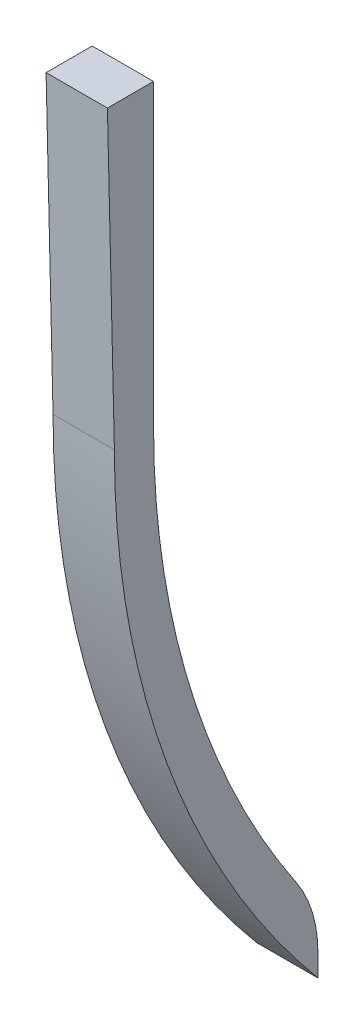
ISO-10303-21;
HEADER;
FILE_DESCRIPTION(('STEP AP214'),'2;1');
FILE_NAME('part.step','',(''),(''),'','','');
FILE_SCHEMA(('AUTOMOTIVE_DESIGN { 1 0 10303 214 1 1 1 1 }'));
ENDSEC;
DATA;
#1=APPLICATION_CONTEXT('core data for automotive mechanical design processes');
#2=APPLICATION_PROTOCOL_DEFINITION('international standard','automotive_design',2000,#1);
#3=PRODUCT_CONTEXT('',#1,'mechanical');
#4=PRODUCT('Part','Part','',(#3));
#5=PRODUCT_RELATED_PRODUCT_CATEGORY('part','',(#4));
#6=PRODUCT_DEFINITION_FORMATION('','',#4);
#7=PRODUCT_DEFINITION_CONTEXT('part definition',#1,'design');
#8=PRODUCT_DEFINITION('design','',#6,#7);
#9=PRODUCT_DEFINITION_SHAPE('','',#8);
#10=(LENGTH_UNIT() NAMED_UNIT(*) SI_UNIT(.MILLI.,.METRE.));
#11=(NAMED_UNIT(*) PLANE_ANGLE_UNIT() SI_UNIT($,.RADIAN.));
#12=(NAMED_UNIT(*) SI_UNIT($,.STERADIAN.) SOLID_ANGLE_UNIT());
#13=UNCERTAINTY_MEASURE_WITH_UNIT(LENGTH_MEASURE(1.E-05),#10,'distance_accuracy_value','');
#14=(GEOMETRIC_REPRESENTATION_CONTEXT(3) GLOBAL_UNCERTAINTY_ASSIGNED_CONTEXT((#13)) GLOBAL_UNIT_ASSIGNED_CONTEXT((#10,
#11,#12)) REPRESENTATION_CONTEXT('',''));
#15=CARTESIAN_POINT('',(0.,0.,0.));
#16=DIRECTION('',(0.,0.,1.));
#17=DIRECTION('',(1.,0.,0.));
#18=AXIS2_PLACEMENT_3D('',#15,#16,#17);
#19=CARTESIAN_POINT('',(2.3876,-146.926703399553,-5.84262807197812));
#20=DIRECTION('',(-1.,0.,0.));
#21=DIRECTION('',(0.,0.,1.));
#22=AXIS2_PLACEMENT_3D('',#19,#20,#21);
#23=CYLINDRICAL_SURFACE('',#22,10.);
#24=DIRECTION('',(-1.,0.,0.));
#25=VECTOR('',#24,1.);
#26=CARTESIAN_POINT('',(2.3876,-146.926703399553,-15.8426280719781));
#27=LINE('',#26,#25);
#28=CARTESIAN_POINT('',(-2.3876,-146.926703399553,-15.8426280719781));
#29=VERTEX_POINT('',#28);
#30=CARTESIAN_POINT('',(2.3876,-146.926703399553,-15.8426280719781));
#31=VERTEX_POINT('',#30);
#32=EDGE_CURVE('E132',#29,#31,#27,.F.);
#33=ORIENTED_EDGE('',*,*,#32,.F.);
#34=CARTESIAN_POINT('',(-2.3876,-146.926703399553,-5.84262807197812));
#35=DIRECTION('',(1.,0.,0.));
#36=DIRECTION('',(0.,0.,-1.));
#37=AXIS2_PLACEMENT_3D('',#34,#35,#36);
#38=CIRCLE('',#37,10.);
#39=CARTESIAN_POINT('',(-2.3876,-141.328993454883,-14.1291015906315));
#40=VERTEX_POINT('',#39);
#41=EDGE_CURVE('E48',#40,#29,#38,.F.);
#42=ORIENTED_EDGE('',*,*,#41,.F.);
#43=DIRECTION('',(-1.,0.,0.));
#44=VECTOR('',#43,1.);
#45=CARTESIAN_POINT('',(2.3876,-141.328993454883,-14.1291015906315));
#46=LINE('',#45,#44);
#47=CARTESIAN_POINT('',(2.3876,-141.328993454883,-14.1291015906315));
#48=VERTEX_POINT('',#47);
#49=EDGE_CURVE('E142',#48,#40,#46,.T.);
#50=ORIENTED_EDGE('',*,*,#49,.F.);
#51=CARTESIAN_POINT('',(2.3876,-146.926703399553,-5.84262807197812));
#52=DIRECTION('',(1.,0.,0.));
#53=DIRECTION('',(0.,0.,-1.));
#54=AXIS2_PLACEMENT_3D('',#51,#52,#53);
#55=CIRCLE('',#54,10.);
#56=EDGE_CURVE('E11',#31,#48,#55,.T.);
#57=ORIENTED_EDGE('',*,*,#56,.F.);
#58=EDGE_LOOP('',(#33,#42,#50,#57));
#59=FACE_BOUND('',#58,.T.);
#60=ADVANCED_FACE('F41',(#59),#23,.T.);
#61=CARTESIAN_POINT('',(2.3876,-105.129498876294,-67.7164));
#62=DIRECTION('',(-1.,0.,0.));
#63=DIRECTION('',(0.,0.,1.));
#64=AXIS2_PLACEMENT_3D('',#61,#62,#63);
#65=CYLINDRICAL_SURFACE('',#64,64.6684);
#66=CARTESIAN_POINT('',(2.3876,-105.129498876294,-67.7164));
#67=DIRECTION('',(-1.,0.,0.));
#68=DIRECTION('',(0.,0.,-1.));
#69=AXIS2_PLACEMENT_3D('',#66,#67,#68);
#70=CIRCLE('',#69,64.6684);
#71=CARTESIAN_POINT('',(2.3876,-105.129498876294,-3.048));
#72=VERTEX_POINT('',#71);
#73=EDGE_CURVE('E119',#48,#72,#70,.T.);
#74=ORIENTED_EDGE('',*,*,#73,.F.);
#75=ORIENTED_EDGE('',*,*,#49,.T.);
#76=CARTESIAN_POINT('',(-2.3876,-105.129498876294,-67.7164));
#77=DIRECTION('',(-1.,0.,0.));
#78=DIRECTION('',(0.,0.,-1.));
#79=AXIS2_PLACEMENT_3D('',#76,#77,#78);
#80=CIRCLE('',#79,64.6684);
#81=CARTESIAN_POINT('',(-2.3876,-105.129498876294,-3.048));
#82=VERTEX_POINT('',#81);
#83=EDGE_CURVE('E130',#40,#82,#80,.T.);
#84=ORIENTED_EDGE('',*,*,#83,.T.);
#85=DIRECTION('',(-1.,0.,0.));
#86=VECTOR('',#85,1.);
#87=CARTESIAN_POINT('',(2.3876,-105.129498876294,-3.048));
#88=LINE('',#87,#86);
#89=EDGE_CURVE('E154',#72,#82,#88,.T.);
#90=ORIENTED_EDGE('',*,*,#89,.F.);
#91=EDGE_LOOP('',(#74,#75,#84,#90));
#92=FACE_BOUND('',#91,.T.);
#93=ADVANCED_FACE('F145',(#92),#65,.F.);
#94=CARTESIAN_POINT('',(2.3876,-105.129498876294,-3.048));
#95=DIRECTION('',(0.,0.,1.));
#96=DIRECTION('',(1.,0.,0.));
#97=AXIS2_PLACEMENT_3D('',#94,#95,#96);
#98=PLANE('',#97);
#99=DIRECTION('',(0.,1.,0.));
#100=VECTOR('',#99,1.);
#101=CARTESIAN_POINT('',(-2.3876,-105.129498876294,-3.048));
#102=LINE('',#101,#100);
#103=CARTESIAN_POINT('',(-2.3876,-81.8206210986452,-3.048));
#104=VERTEX_POINT('',#103);
#105=EDGE_CURVE('E128',#82,#104,#102,.T.);
#106=ORIENTED_EDGE('',*,*,#105,.T.);
#107=DIRECTION('',(-1.,0.,0.));
#108=VECTOR('',#107,1.);
#109=CARTESIAN_POINT('',(2.3876,-81.8206210986452,-3.048));
#110=LINE('',#109,#108);
#111=CARTESIAN_POINT('',(2.3876,-81.8206210986452,-3.048));
#112=VERTEX_POINT('',#111);
#113=EDGE_CURVE('E156',#112,#104,#110,.T.);
#114=ORIENTED_EDGE('',*,*,#113,.F.);
#115=DIRECTION('',(0.,1.,0.));
#116=VECTOR('',#115,1.);
#117=CARTESIAN_POINT('',(2.3876,-105.129498876294,-3.048));
#118=LINE('',#117,#116);
#119=EDGE_CURVE('E121',#72,#112,#118,.T.);
#120=ORIENTED_EDGE('',*,*,#119,.F.);
#121=ORIENTED_EDGE('',*,*,#89,.T.);
#122=EDGE_LOOP('',(#106,#114,#120,#121));
#123=FACE_BOUND('',#122,.T.);
#124=ADVANCED_FACE('F155',(#123),#98,.F.);
#125=CARTESIAN_POINT('',(2.3876,-81.8206210986452,-3.048));
#126=DIRECTION('',(0.,-1.,0.));
#127=DIRECTION('',(0.,0.,-1.));
#128=AXIS2_PLACEMENT_3D('',#125,#126,#127);
#129=PLANE('',#128);
#130=DIRECTION('',(0.,0.,1.));
#131=VECTOR('',#130,1.);
#132=CARTESIAN_POINT('',(-2.3876,-81.8206210986452,-3.048));
#133=LINE('',#132,#131);
#134=CARTESIAN_POINT('',(-2.3876,-81.8206210986452,0.5411957343429));
#135=VERTEX_POINT('',#134);
#136=EDGE_CURVE('E126',#104,#135,#133,.T.);
#137=ORIENTED_EDGE('',*,*,#136,.T.);
#138=DIRECTION('',(-1.,0.,0.));
#139=VECTOR('',#138,1.);
#140=CARTESIAN_POINT('',(2.3876,-81.8206210986452,0.5411957343429));
#141=LINE('',#140,#139);
#142=CARTESIAN_POINT('',(2.3876,-81.8206210986452,0.5411957343429));
#143=VERTEX_POINT('',#142);
#144=EDGE_CURVE('E158',#143,#135,#141,.T.);
#145=ORIENTED_EDGE('',*,*,#144,.F.);
#146=DIRECTION('',(0.,0.,1.));
#147=VECTOR('',#146,1.);
#148=CARTESIAN_POINT('',(2.3876,-81.8206210986452,-3.048));
#149=LINE('',#148,#147);
#150=EDGE_CURVE('E138',#112,#143,#149,.T.);
#151=ORIENTED_EDGE('',*,*,#150,.F.);
#152=ORIENTED_EDGE('',*,*,#113,.T.);
#153=EDGE_LOOP('',(#137,#145,#151,#152));
#154=FACE_BOUND('',#153,.T.);
#155=ADVANCED_FACE('F168',(#154),#129,.F.);
#156=CARTESIAN_POINT('',(2.3876,-81.8206210986452,0.5411957343429));
#157=DIRECTION('',(0.,0.0232121820822183,-0.999730561002804));
#158=DIRECTION('',(0.,0.999730561002805,0.0232121820822183));
#159=AXIS2_PLACEMENT_3D('',#156,#157,#158);
#160=PLANE('',#159);
#161=DIRECTION('',(0.,-0.999730561002804,-0.0232121820822183));
#162=VECTOR('',#161,1.);
#163=CARTESIAN_POINT('',(-2.3876,-81.8206210986452,0.5411957343429));
#164=LINE('',#163,#162);
#165=CARTESIAN_POINT('',(-2.3876,-105.129498876294,0.));
#166=VERTEX_POINT('',#165);
#167=EDGE_CURVE('E108',#135,#166,#164,.T.);
#168=ORIENTED_EDGE('',*,*,#167,.T.);
#169=DIRECTION('',(-1.,0.,0.));
#170=VECTOR('',#169,1.);
#171=CARTESIAN_POINT('',(2.3876,-105.129498876294,0.));
#172=LINE('',#171,#170);
#173=CARTESIAN_POINT('',(2.3876,-105.129498876294,0.));
#174=VERTEX_POINT('',#173);
#175=EDGE_CURVE('E104',#174,#166,#172,.T.);
#176=ORIENTED_EDGE('',*,*,#175,.F.);
#177=DIRECTION('',(0.,-0.999730561002804,-0.0232121820822183));
#178=VECTOR('',#177,1.);
#179=CARTESIAN_POINT('',(2.3876,-81.8206210986452,0.5411957343429));
#180=LINE('',#179,#178);
#181=EDGE_CURVE('E136',#143,#174,#180,.T.);
#182=ORIENTED_EDGE('',*,*,#181,.F.);
#183=ORIENTED_EDGE('',*,*,#144,.T.);
#184=EDGE_LOOP('',(#168,#176,#182,#183));
#185=FACE_BOUND('',#184,.T.);
#186=ADVANCED_FACE('F165',(#185),#160,.F.);
#187=CARTESIAN_POINT('',(2.3876,-105.129498876294,-67.7164));
#188=DIRECTION('',(-1.,0.,0.));
#189=DIRECTION('',(0.,0.,1.));
#190=AXIS2_PLACEMENT_3D('',#187,#188,#189);
#191=CYLINDRICAL_SURFACE('',#190,67.7164);
#192=CARTESIAN_POINT('',(-2.3876,-105.129498876294,-67.7164));
#193=DIRECTION('',(1.,0.,0.));
#194=DIRECTION('',(0.,0.,-1.));
#195=AXIS2_PLACEMENT_3D('',#192,#193,#194);
#196=CIRCLE('',#195,67.7164);
#197=CARTESIAN_POINT('',(-2.3876,-148.656761768872,-15.8426280719781));
#198=VERTEX_POINT('',#197);
#199=EDGE_CURVE('E97',#166,#198,#196,.T.);
#200=ORIENTED_EDGE('',*,*,#199,.T.);
#201=DIRECTION('',(-1.,0.,0.));
#202=VECTOR('',#201,1.);
#203=CARTESIAN_POINT('',(2.3876,-148.656761768872,-15.8426280719781));
#204=LINE('',#203,#202);
#205=CARTESIAN_POINT('',(2.3876,-148.656761768872,-15.8426280719781));
#206=VERTEX_POINT('',#205);
#207=EDGE_CURVE('E101',#206,#198,#204,.T.);
#208=ORIENTED_EDGE('',*,*,#207,.F.);
#209=CARTESIAN_POINT('',(2.3876,-105.129498876294,-67.7164));
#210=DIRECTION('',(1.,0.,0.));
#211=DIRECTION('',(0.,0.,-1.));
#212=AXIS2_PLACEMENT_3D('',#209,#210,#211);
#213=CIRCLE('',#212,67.7164);
#214=EDGE_CURVE('E134',#174,#206,#213,.T.);
#215=ORIENTED_EDGE('',*,*,#214,.F.);
#216=ORIENTED_EDGE('',*,*,#175,.T.);
#217=EDGE_LOOP('',(#200,#208,#215,#216));
#218=FACE_BOUND('',#217,.T.);
#219=ADVANCED_FACE('F99',(#218),#191,.T.);
#220=CARTESIAN_POINT('',(2.3876,-148.656761768872,-15.8426280719781));
#221=DIRECTION('',(0.,0.,1.));
#222=DIRECTION('',(0.,-1.,0.));
#223=AXIS2_PLACEMENT_3D('',#220,#221,#222);
#224=PLANE('',#223);
#225=DIRECTION('',(0.,1.,0.));
#226=VECTOR('',#225,1.);
#227=CARTESIAN_POINT('',(-2.3876,-148.656761768872,-15.8426280719781));
#228=LINE('',#227,#226);
#229=EDGE_CURVE('E109',#198,#29,#228,.T.);
#230=ORIENTED_EDGE('',*,*,#229,.T.);
#231=ORIENTED_EDGE('',*,*,#32,.T.);
#232=DIRECTION('',(0.,1.,0.));
#233=VECTOR('',#232,1.);
#234=CARTESIAN_POINT('',(2.3876,-148.656761768872,-15.8426280719781));
#235=LINE('',#234,#233);
#236=EDGE_CURVE('E115',#206,#31,#235,.T.);
#237=ORIENTED_EDGE('',*,*,#236,.F.);
#238=ORIENTED_EDGE('',*,*,#207,.T.);
#239=EDGE_LOOP('',(#230,#231,#237,#238));
#240=FACE_BOUND('',#239,.T.);
#241=ADVANCED_FACE('F113',(#240),#224,.F.);
#242=CARTESIAN_POINT('',(2.3876,-105.129498876294,-67.7164));
#243=DIRECTION('',(1.,0.,0.));
#244=DIRECTION('',(0.,0.,-1.));
#245=AXIS2_PLACEMENT_3D('',#242,#243,#244);
#246=PLANE('',#245);
#247=ORIENTED_EDGE('',*,*,#236,.T.);
#248=ORIENTED_EDGE('',*,*,#56,.T.);
#249=ORIENTED_EDGE('',*,*,#73,.T.);
#250=ORIENTED_EDGE('',*,*,#119,.T.);
#251=ORIENTED_EDGE('',*,*,#150,.T.);
#252=ORIENTED_EDGE('',*,*,#181,.T.);
#253=ORIENTED_EDGE('',*,*,#214,.T.);
#254=EDGE_LOOP('',(#247,#248,#249,#250,#251,#252,#253));
#255=FACE_BOUND('',#254,.T.);
#256=ADVANCED_FACE('F169',(#255),#246,.T.);
#257=CARTESIAN_POINT('',(-2.3876,-105.129498876294,-67.7164));
#258=DIRECTION('',(1.,0.,0.));
#259=DIRECTION('',(0.,0.,-1.));
#260=AXIS2_PLACEMENT_3D('',#257,#258,#259);
#261=PLANE('',#260);
#262=ORIENTED_EDGE('',*,*,#83,.F.);
#263=ORIENTED_EDGE('',*,*,#41,.T.);
#264=ORIENTED_EDGE('',*,*,#229,.F.);
#265=ORIENTED_EDGE('',*,*,#199,.F.);
#266=ORIENTED_EDGE('',*,*,#167,.F.);
#267=ORIENTED_EDGE('',*,*,#136,.F.);
#268=ORIENTED_EDGE('',*,*,#105,.F.);
#269=EDGE_LOOP('',(#262,#263,#264,#265,#266,#267,#268));
#270=FACE_BOUND('',#269,.T.);
#271=ADVANCED_FACE('F118',(#270),#261,.F.);
#272=CLOSED_SHELL('',(#60,#93,#124,#155,#186,#219,#241,#256,#271));
#273=MANIFOLD_SOLID_BREP('B2',#272);
#274=ADVANCED_BREP_SHAPE_REPRESENTATION('',(#18,#273),#14);
#275=SHAPE_DEFINITION_REPRESENTATION(#9,#274);
ENDSEC;
END-ISO-10303-21;
